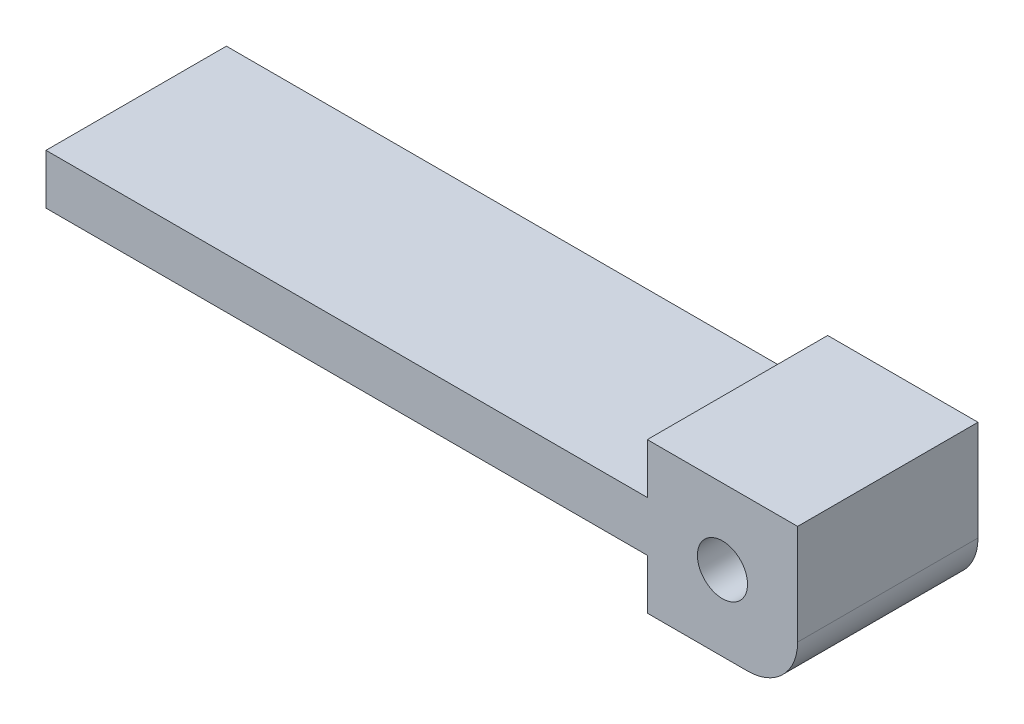
ISO-10303-21;
HEADER;
FILE_DESCRIPTION(('STEP AP214'),'2;1');
FILE_NAME('part.step','',(''),(''),'','','');
FILE_SCHEMA(('AUTOMOTIVE_DESIGN { 1 0 10303 214 1 1 1 1 }'));
ENDSEC;
DATA;
#1=APPLICATION_CONTEXT('core data for automotive mechanical design processes');
#2=APPLICATION_PROTOCOL_DEFINITION('international standard','automotive_design',2000,#1);
#3=PRODUCT_CONTEXT('',#1,'mechanical');
#4=PRODUCT('Part','Part','',(#3));
#5=PRODUCT_RELATED_PRODUCT_CATEGORY('part','',(#4));
#6=PRODUCT_DEFINITION_FORMATION('','',#4);
#7=PRODUCT_DEFINITION_CONTEXT('part definition',#1,'design');
#8=PRODUCT_DEFINITION('design','',#6,#7);
#9=PRODUCT_DEFINITION_SHAPE('','',#8);
#10=(LENGTH_UNIT() NAMED_UNIT(*) SI_UNIT(.MILLI.,.METRE.));
#11=(NAMED_UNIT(*) PLANE_ANGLE_UNIT() SI_UNIT($,.RADIAN.));
#12=(NAMED_UNIT(*) SI_UNIT($,.STERADIAN.) SOLID_ANGLE_UNIT());
#13=UNCERTAINTY_MEASURE_WITH_UNIT(LENGTH_MEASURE(1.E-05),#10,'distance_accuracy_value','');
#14=(GEOMETRIC_REPRESENTATION_CONTEXT(3) GLOBAL_UNCERTAINTY_ASSIGNED_CONTEXT((#13)) GLOBAL_UNIT_ASSIGNED_CONTEXT((#10,
#11,#12)) REPRESENTATION_CONTEXT('',''));
#15=CARTESIAN_POINT('',(0.,0.,0.));
#16=DIRECTION('',(0.,0.,1.));
#17=DIRECTION('',(1.,0.,0.));
#18=AXIS2_PLACEMENT_3D('',#15,#16,#17);
#19=CARTESIAN_POINT('',(0.,15.,18.));
#20=DIRECTION('',(-1.,0.,0.));
#21=DIRECTION('',(0.,-1.,0.));
#22=AXIS2_PLACEMENT_3D('',#19,#20,#21);
#23=PLANE('',#22);
#24=DIRECTION('',(0.,1.,0.));
#25=VECTOR('',#24,1.);
#26=CARTESIAN_POINT('',(0.,15.,18.));
#27=LINE('',#26,#25);
#28=CARTESIAN_POINT('',(0.,5.,18.));
#29=VERTEX_POINT('',#28);
#30=CARTESIAN_POINT('',(0.,15.,18.));
#31=VERTEX_POINT('',#30);
#32=EDGE_CURVE('E102',#29,#31,#27,.T.);
#33=ORIENTED_EDGE('',*,*,#32,.F.);
#34=DIRECTION('',(0.,0.,-1.));
#35=VECTOR('',#34,1.);
#36=CARTESIAN_POINT('',(0.,5.,18.));
#37=LINE('',#36,#35);
#38=CARTESIAN_POINT('',(0.,5.,0.));
#39=VERTEX_POINT('',#38);
#40=EDGE_CURVE('E125',#29,#39,#37,.T.);
#41=ORIENTED_EDGE('',*,*,#40,.T.);
#42=DIRECTION('',(0.,1.,0.));
#43=VECTOR('',#42,1.);
#44=CARTESIAN_POINT('',(0.,15.,0.));
#45=LINE('',#44,#43);
#46=CARTESIAN_POINT('',(0.,15.,0.));
#47=VERTEX_POINT('',#46);
#48=EDGE_CURVE('E123',#39,#47,#45,.T.);
#49=ORIENTED_EDGE('',*,*,#48,.T.);
#50=DIRECTION('',(0.,0.,-1.));
#51=VECTOR('',#50,1.);
#52=CARTESIAN_POINT('',(0.,15.,18.));
#53=LINE('',#52,#51);
#54=EDGE_CURVE('E117',#31,#47,#53,.T.);
#55=ORIENTED_EDGE('',*,*,#54,.F.);
#56=EDGE_LOOP('',(#33,#41,#49,#55));
#57=FACE_BOUND('',#56,.T.);
#58=ADVANCED_FACE('F32',(#57),#23,.F.);
#59=CARTESIAN_POINT('',(-15.,15.,18.));
#60=DIRECTION('',(0.,-1.,0.));
#61=DIRECTION('',(0.,0.,-1.));
#62=AXIS2_PLACEMENT_3D('',#59,#60,#61);
#63=PLANE('',#62);
#64=DIRECTION('',(-1.,0.,0.));
#65=VECTOR('',#64,1.);
#66=CARTESIAN_POINT('',(-15.,15.,0.));
#67=LINE('',#66,#65);
#68=CARTESIAN_POINT('',(-15.,15.,0.));
#69=VERTEX_POINT('',#68);
#70=EDGE_CURVE('E158',#47,#69,#67,.T.);
#71=ORIENTED_EDGE('',*,*,#70,.T.);
#72=DIRECTION('',(0.,0.,-1.));
#73=VECTOR('',#72,1.);
#74=CARTESIAN_POINT('',(-15.,15.,18.));
#75=LINE('',#74,#73);
#76=CARTESIAN_POINT('',(-15.,15.,18.));
#77=VERTEX_POINT('',#76);
#78=EDGE_CURVE('E119',#77,#69,#75,.T.);
#79=ORIENTED_EDGE('',*,*,#78,.F.);
#80=DIRECTION('',(-1.,0.,0.));
#81=VECTOR('',#80,1.);
#82=CARTESIAN_POINT('',(-15.,15.,18.));
#83=LINE('',#82,#81);
#84=EDGE_CURVE('E105',#31,#77,#83,.T.);
#85=ORIENTED_EDGE('',*,*,#84,.F.);
#86=ORIENTED_EDGE('',*,*,#54,.T.);
#87=EDGE_LOOP('',(#71,#79,#85,#86));
#88=FACE_BOUND('',#87,.T.);
#89=ADVANCED_FACE('F116',(#88),#63,.F.);
#90=CARTESIAN_POINT('',(-15.,9.99999999999999,18.));
#91=DIRECTION('',(1.,0.,0.));
#92=DIRECTION('',(0.,1.,0.));
#93=AXIS2_PLACEMENT_3D('',#90,#91,#92);
#94=PLANE('',#93);
#95=DIRECTION('',(0.,-1.,0.));
#96=VECTOR('',#95,1.);
#97=CARTESIAN_POINT('',(-15.,9.99999999999999,0.));
#98=LINE('',#97,#96);
#99=CARTESIAN_POINT('',(-15.,9.99999999999999,0.));
#100=VERTEX_POINT('',#99);
#101=EDGE_CURVE('E156',#69,#100,#98,.T.);
#102=ORIENTED_EDGE('',*,*,#101,.T.);
#103=DIRECTION('',(0.,0.,-1.));
#104=VECTOR('',#103,1.);
#105=CARTESIAN_POINT('',(-15.,9.99999999999999,18.));
#106=LINE('',#105,#104);
#107=CARTESIAN_POINT('',(-15.,9.99999999999999,18.));
#108=VERTEX_POINT('',#107);
#109=EDGE_CURVE('E128',#108,#100,#106,.T.);
#110=ORIENTED_EDGE('',*,*,#109,.F.);
#111=DIRECTION('',(0.,-1.,0.));
#112=VECTOR('',#111,1.);
#113=CARTESIAN_POINT('',(-15.,9.99999999999999,18.));
#114=LINE('',#113,#112);
#115=EDGE_CURVE('E121',#77,#108,#114,.T.);
#116=ORIENTED_EDGE('',*,*,#115,.F.);
#117=ORIENTED_EDGE('',*,*,#78,.T.);
#118=EDGE_LOOP('',(#102,#110,#116,#117));
#119=FACE_BOUND('',#118,.T.);
#120=ADVANCED_FACE('F200',(#119),#94,.F.);
#121=CARTESIAN_POINT('',(-75.,9.99999999999999,18.));
#122=DIRECTION('',(0.,-1.,0.));
#123=DIRECTION('',(0.,0.,-1.));
#124=AXIS2_PLACEMENT_3D('',#121,#122,#123);
#125=PLANE('',#124);
#126=DIRECTION('',(-1.,0.,0.));
#127=VECTOR('',#126,1.);
#128=CARTESIAN_POINT('',(-75.,9.99999999999999,0.));
#129=LINE('',#128,#127);
#130=CARTESIAN_POINT('',(-75.,9.99999999999999,0.));
#131=VERTEX_POINT('',#130);
#132=EDGE_CURVE('E154',#100,#131,#129,.T.);
#133=ORIENTED_EDGE('',*,*,#132,.T.);
#134=DIRECTION('',(0.,0.,-1.));
#135=VECTOR('',#134,1.);
#136=CARTESIAN_POINT('',(-75.,9.99999999999999,18.));
#137=LINE('',#136,#135);
#138=CARTESIAN_POINT('',(-75.,9.99999999999999,18.));
#139=VERTEX_POINT('',#138);
#140=EDGE_CURVE('E134',#139,#131,#137,.T.);
#141=ORIENTED_EDGE('',*,*,#140,.F.);
#142=DIRECTION('',(-1.,0.,0.));
#143=VECTOR('',#142,1.);
#144=CARTESIAN_POINT('',(-75.,9.99999999999999,18.));
#145=LINE('',#144,#143);
#146=EDGE_CURVE('E169',#108,#139,#145,.T.);
#147=ORIENTED_EDGE('',*,*,#146,.F.);
#148=ORIENTED_EDGE('',*,*,#109,.T.);
#149=EDGE_LOOP('',(#133,#141,#147,#148));
#150=FACE_BOUND('',#149,.T.);
#151=ADVANCED_FACE('F205',(#150),#125,.F.);
#152=CARTESIAN_POINT('',(-75.,4.99999999999999,18.));
#153=DIRECTION('',(1.,0.,0.));
#154=DIRECTION('',(0.,0.,-1.));
#155=AXIS2_PLACEMENT_3D('',#152,#153,#154);
#156=PLANE('',#155);
#157=DIRECTION('',(0.,-1.,0.));
#158=VECTOR('',#157,1.);
#159=CARTESIAN_POINT('',(-75.,4.99999999999999,0.));
#160=LINE('',#159,#158);
#161=CARTESIAN_POINT('',(-75.,4.99999999999999,0.));
#162=VERTEX_POINT('',#161);
#163=EDGE_CURVE('E152',#131,#162,#160,.T.);
#164=ORIENTED_EDGE('',*,*,#163,.T.);
#165=DIRECTION('',(0.,0.,-1.));
#166=VECTOR('',#165,1.);
#167=CARTESIAN_POINT('',(-75.,4.99999999999999,18.));
#168=LINE('',#167,#166);
#169=CARTESIAN_POINT('',(-75.,4.99999999999999,18.));
#170=VERTEX_POINT('',#169);
#171=EDGE_CURVE('E137',#170,#162,#168,.T.);
#172=ORIENTED_EDGE('',*,*,#171,.F.);
#173=DIRECTION('',(0.,-1.,0.));
#174=VECTOR('',#173,1.);
#175=CARTESIAN_POINT('',(-75.,4.99999999999999,18.));
#176=LINE('',#175,#174);
#177=EDGE_CURVE('E167',#139,#170,#176,.T.);
#178=ORIENTED_EDGE('',*,*,#177,.F.);
#179=ORIENTED_EDGE('',*,*,#140,.T.);
#180=EDGE_LOOP('',(#164,#172,#178,#179));
#181=FACE_BOUND('',#180,.T.);
#182=ADVANCED_FACE('F209',(#181),#156,.F.);
#183=CARTESIAN_POINT('',(-15.,5.,18.));
#184=DIRECTION('',(0.,1.,0.));
#185=DIRECTION('',(-1.,0.,0.));
#186=AXIS2_PLACEMENT_3D('',#183,#184,#185);
#187=PLANE('',#186);
#188=DIRECTION('',(1.,0.,0.));
#189=VECTOR('',#188,1.);
#190=CARTESIAN_POINT('',(-15.,5.,0.));
#191=LINE('',#190,#189);
#192=CARTESIAN_POINT('',(-15.,5.,0.));
#193=VERTEX_POINT('',#192);
#194=EDGE_CURVE('E150',#162,#193,#191,.T.);
#195=ORIENTED_EDGE('',*,*,#194,.T.);
#196=DIRECTION('',(0.,0.,-1.));
#197=VECTOR('',#196,1.);
#198=CARTESIAN_POINT('',(-15.,5.,18.));
#199=LINE('',#198,#197);
#200=CARTESIAN_POINT('',(-15.,5.,18.));
#201=VERTEX_POINT('',#200);
#202=EDGE_CURVE('E140',#201,#193,#199,.T.);
#203=ORIENTED_EDGE('',*,*,#202,.F.);
#204=DIRECTION('',(1.,0.,0.));
#205=VECTOR('',#204,1.);
#206=CARTESIAN_POINT('',(-15.,5.,18.));
#207=LINE('',#206,#205);
#208=EDGE_CURVE('E165',#170,#201,#207,.T.);
#209=ORIENTED_EDGE('',*,*,#208,.F.);
#210=ORIENTED_EDGE('',*,*,#171,.T.);
#211=EDGE_LOOP('',(#195,#203,#209,#210));
#212=FACE_BOUND('',#211,.T.);
#213=ADVANCED_FACE('F213',(#212),#187,.F.);
#214=CARTESIAN_POINT('',(-15.,0.,18.));
#215=DIRECTION('',(1.,0.,0.));
#216=DIRECTION('',(0.,0.,-1.));
#217=AXIS2_PLACEMENT_3D('',#214,#215,#216);
#218=PLANE('',#217);
#219=DIRECTION('',(0.,-1.,0.));
#220=VECTOR('',#219,1.);
#221=CARTESIAN_POINT('',(-15.,0.,0.));
#222=LINE('',#221,#220);
#223=CARTESIAN_POINT('',(-15.,0.,0.));
#224=VERTEX_POINT('',#223);
#225=EDGE_CURVE('E148',#193,#224,#222,.T.);
#226=ORIENTED_EDGE('',*,*,#225,.T.);
#227=DIRECTION('',(0.,0.,-1.));
#228=VECTOR('',#227,1.);
#229=CARTESIAN_POINT('',(-15.,0.,18.));
#230=LINE('',#229,#228);
#231=CARTESIAN_POINT('',(-15.,0.,18.));
#232=VERTEX_POINT('',#231);
#233=EDGE_CURVE('E143',#232,#224,#230,.T.);
#234=ORIENTED_EDGE('',*,*,#233,.F.);
#235=DIRECTION('',(0.,-1.,0.));
#236=VECTOR('',#235,1.);
#237=CARTESIAN_POINT('',(-15.,0.,18.));
#238=LINE('',#237,#236);
#239=EDGE_CURVE('E163',#201,#232,#238,.T.);
#240=ORIENTED_EDGE('',*,*,#239,.F.);
#241=ORIENTED_EDGE('',*,*,#202,.T.);
#242=EDGE_LOOP('',(#226,#234,#240,#241));
#243=FACE_BOUND('',#242,.T.);
#244=ADVANCED_FACE('F194',(#243),#218,.F.);
#245=CARTESIAN_POINT('',(0.,0.,18.));
#246=DIRECTION('',(0.,1.,0.));
#247=DIRECTION('',(-1.,0.,0.));
#248=AXIS2_PLACEMENT_3D('',#245,#246,#247);
#249=PLANE('',#248);
#250=DIRECTION('',(1.,0.,0.));
#251=VECTOR('',#250,1.);
#252=CARTESIAN_POINT('',(0.,0.,0.));
#253=LINE('',#252,#251);
#254=CARTESIAN_POINT('',(-5.,0.,0.));
#255=VERTEX_POINT('',#254);
#256=EDGE_CURVE('E112',#224,#255,#253,.T.);
#257=ORIENTED_EDGE('',*,*,#256,.T.);
#258=DIRECTION('',(0.,0.,-1.));
#259=VECTOR('',#258,1.);
#260=CARTESIAN_POINT('',(-5.,0.,18.));
#261=LINE('',#260,#259);
#262=CARTESIAN_POINT('',(-5.,0.,18.));
#263=VERTEX_POINT('',#262);
#264=EDGE_CURVE('E40',#255,#263,#261,.F.);
#265=ORIENTED_EDGE('',*,*,#264,.T.);
#266=DIRECTION('',(1.,0.,0.));
#267=VECTOR('',#266,1.);
#268=CARTESIAN_POINT('',(0.,0.,18.));
#269=LINE('',#268,#267);
#270=EDGE_CURVE('E146',#232,#263,#269,.T.);
#271=ORIENTED_EDGE('',*,*,#270,.F.);
#272=ORIENTED_EDGE('',*,*,#233,.T.);
#273=EDGE_LOOP('',(#257,#265,#271,#272));
#274=FACE_BOUND('',#273,.T.);
#275=ADVANCED_FACE('F187',(#274),#249,.F.);
#276=CARTESIAN_POINT('',(0.,0.,18.));
#277=DIRECTION('',(0.,0.,-1.));
#278=DIRECTION('',(-1.,0.,0.));
#279=AXIS2_PLACEMENT_3D('',#276,#277,#278);
#280=PLANE('',#279);
#281=CARTESIAN_POINT('',(-7.5,7.5,18.));
#282=DIRECTION('',(0.,0.,1.));
#283=DIRECTION('',(1.,0.,0.));
#284=AXIS2_PLACEMENT_3D('',#281,#282,#283);
#285=CIRCLE('',#284,2.5);
#286=CARTESIAN_POINT('',(-5.,7.5,18.));
#287=VERTEX_POINT('',#286);
#288=EDGE_CURVE('E172',#287,#287,#285,.T.);
#289=ORIENTED_EDGE('',*,*,#288,.F.);
#290=EDGE_LOOP('',(#289));
#291=FACE_BOUND('',#290,.T.);
#292=ORIENTED_EDGE('',*,*,#270,.T.);
#293=CARTESIAN_POINT('',(-5.,5.,18.));
#294=DIRECTION('',(0.,0.,-1.));
#295=DIRECTION('',(-1.,0.,0.));
#296=AXIS2_PLACEMENT_3D('',#293,#294,#295);
#297=CIRCLE('',#296,5.);
#298=EDGE_CURVE('E11',#263,#29,#297,.F.);
#299=ORIENTED_EDGE('',*,*,#298,.T.);
#300=ORIENTED_EDGE('',*,*,#32,.T.);
#301=ORIENTED_EDGE('',*,*,#84,.T.);
#302=ORIENTED_EDGE('',*,*,#115,.T.);
#303=ORIENTED_EDGE('',*,*,#146,.T.);
#304=ORIENTED_EDGE('',*,*,#177,.T.);
#305=ORIENTED_EDGE('',*,*,#208,.T.);
#306=ORIENTED_EDGE('',*,*,#239,.T.);
#307=EDGE_LOOP('',(#292,#299,#300,#301,#302,#303,#304,#305,#306));
#308=FACE_BOUND('',#307,.T.);
#309=ADVANCED_FACE('F104',(#291,#308),#280,.F.);
#310=CARTESIAN_POINT('',(0.,0.,0.));
#311=DIRECTION('',(0.,0.,-1.));
#312=DIRECTION('',(-1.,0.,0.));
#313=AXIS2_PLACEMENT_3D('',#310,#311,#312);
#314=PLANE('',#313);
#315=CARTESIAN_POINT('',(-7.5,7.5,0.));
#316=DIRECTION('',(0.,0.,1.));
#317=DIRECTION('',(1.,0.,0.));
#318=AXIS2_PLACEMENT_3D('',#315,#316,#317);
#319=CIRCLE('',#318,2.5);
#320=CARTESIAN_POINT('',(-5.,7.5,0.));
#321=VERTEX_POINT('',#320);
#322=EDGE_CURVE('E161',#321,#321,#319,.T.);
#323=ORIENTED_EDGE('',*,*,#322,.T.);
#324=EDGE_LOOP('',(#323));
#325=FACE_BOUND('',#324,.T.);
#326=ORIENTED_EDGE('',*,*,#48,.F.);
#327=CARTESIAN_POINT('',(-5.,5.,0.));
#328=DIRECTION('',(0.,0.,-1.));
#329=DIRECTION('',(-1.,0.,0.));
#330=AXIS2_PLACEMENT_3D('',#327,#328,#329);
#331=CIRCLE('',#330,5.);
#332=EDGE_CURVE('E54',#39,#255,#331,.T.);
#333=ORIENTED_EDGE('',*,*,#332,.T.);
#334=ORIENTED_EDGE('',*,*,#256,.F.);
#335=ORIENTED_EDGE('',*,*,#225,.F.);
#336=ORIENTED_EDGE('',*,*,#194,.F.);
#337=ORIENTED_EDGE('',*,*,#163,.F.);
#338=ORIENTED_EDGE('',*,*,#132,.F.);
#339=ORIENTED_EDGE('',*,*,#101,.F.);
#340=ORIENTED_EDGE('',*,*,#70,.F.);
#341=EDGE_LOOP('',(#326,#333,#334,#335,#336,#337,#338,#339,#340));
#342=FACE_BOUND('',#341,.T.);
#343=ADVANCED_FACE('F178',(#325,#342),#314,.T.);
#344=CARTESIAN_POINT('',(-7.5,7.5,0.));
#345=DIRECTION('',(0.,0.,1.));
#346=DIRECTION('',(1.,0.,0.));
#347=AXIS2_PLACEMENT_3D('',#344,#345,#346);
#348=CYLINDRICAL_SURFACE('',#347,2.5);
#349=ORIENTED_EDGE('',*,*,#322,.F.);
#350=EDGE_LOOP('',(#349));
#351=FACE_BOUND('',#350,.T.);
#352=ORIENTED_EDGE('',*,*,#288,.T.);
#353=EDGE_LOOP('',(#352));
#354=FACE_BOUND('',#353,.T.);
#355=ADVANCED_FACE('F180',(#351,#354),#348,.F.);
#356=CARTESIAN_POINT('',(-5.,5.,18.));
#357=DIRECTION('',(0.,0.,-1.));
#358=DIRECTION('',(-1.,0.,0.));
#359=AXIS2_PLACEMENT_3D('',#356,#357,#358);
#360=CYLINDRICAL_SURFACE('',#359,5.);
#361=ORIENTED_EDGE('',*,*,#298,.F.);
#362=ORIENTED_EDGE('',*,*,#264,.F.);
#363=ORIENTED_EDGE('',*,*,#332,.F.);
#364=ORIENTED_EDGE('',*,*,#40,.F.);
#365=EDGE_LOOP('',(#361,#362,#363,#364));
#366=FACE_BOUND('',#365,.T.);
#367=ADVANCED_FACE('F34',(#366),#360,.T.);
#368=CLOSED_SHELL('',(#58,#89,#120,#151,#182,#213,#244,#275,#309,#343,#355,#367));
#369=MANIFOLD_SOLID_BREP('B2',#368);
#370=ADVANCED_BREP_SHAPE_REPRESENTATION('',(#18,#369),#14);
#371=SHAPE_DEFINITION_REPRESENTATION(#9,#370);
ENDSEC;
END-ISO-10303-21;
